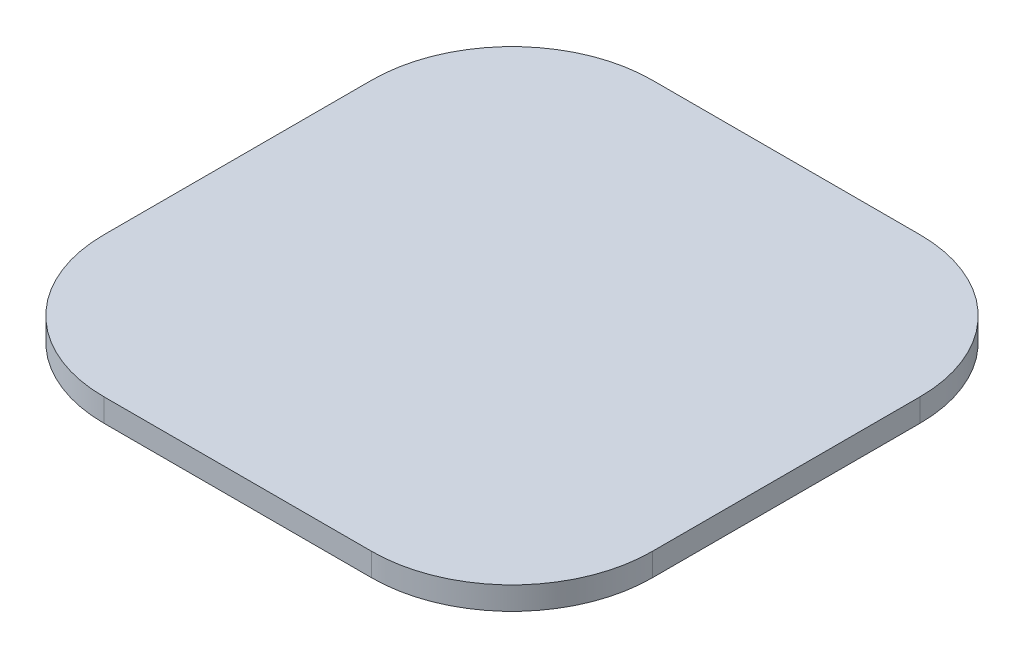
ISO-10303-21;
HEADER;
FILE_DESCRIPTION(('STEP AP214'),'2;1');
FILE_NAME('part.step','',(''),(''),'','','');
FILE_SCHEMA(('AUTOMOTIVE_DESIGN { 1 0 10303 214 1 1 1 1 }'));
ENDSEC;
DATA;
#1=APPLICATION_CONTEXT('core data for automotive mechanical design processes');
#2=APPLICATION_PROTOCOL_DEFINITION('international standard','automotive_design',2000,#1);
#3=PRODUCT_CONTEXT('',#1,'mechanical');
#4=PRODUCT('Part','Part','',(#3));
#5=PRODUCT_RELATED_PRODUCT_CATEGORY('part','',(#4));
#6=PRODUCT_DEFINITION_FORMATION('','',#4);
#7=PRODUCT_DEFINITION_CONTEXT('part definition',#1,'design');
#8=PRODUCT_DEFINITION('design','',#6,#7);
#9=PRODUCT_DEFINITION_SHAPE('','',#8);
#10=(LENGTH_UNIT() NAMED_UNIT(*) SI_UNIT(.MILLI.,.METRE.));
#11=(NAMED_UNIT(*) PLANE_ANGLE_UNIT() SI_UNIT($,.RADIAN.));
#12=(NAMED_UNIT(*) SI_UNIT($,.STERADIAN.) SOLID_ANGLE_UNIT());
#13=UNCERTAINTY_MEASURE_WITH_UNIT(LENGTH_MEASURE(1.E-05),#10,'distance_accuracy_value','');
#14=(GEOMETRIC_REPRESENTATION_CONTEXT(3) GLOBAL_UNCERTAINTY_ASSIGNED_CONTEXT((#13)) GLOBAL_UNIT_ASSIGNED_CONTEXT((#10,
#11,#12)) REPRESENTATION_CONTEXT('',''));
#15=CARTESIAN_POINT('',(0.,0.,0.));
#16=DIRECTION('',(0.,0.,1.));
#17=DIRECTION('',(1.,0.,0.));
#18=AXIS2_PLACEMENT_3D('',#15,#16,#17);
#19=CARTESIAN_POINT('',(-10.5,1.8,10.5));
#20=DIRECTION('',(0.,-1.,0.));
#21=DIRECTION('',(0.,0.,-1.));
#22=AXIS2_PLACEMENT_3D('',#19,#20,#21);
#23=CYLINDRICAL_SURFACE('',#22,11.);
#24=CARTESIAN_POINT('',(-10.5,0.,10.5));
#25=DIRECTION('',(0.,1.,0.));
#26=DIRECTION('',(0.,0.,-1.));
#27=AXIS2_PLACEMENT_3D('',#24,#25,#26);
#28=CIRCLE('',#27,11.);
#29=CARTESIAN_POINT('',(-21.5,0.,10.5));
#30=VERTEX_POINT('',#29);
#31=CARTESIAN_POINT('',(-10.5,0.,21.5));
#32=VERTEX_POINT('',#31);
#33=EDGE_CURVE('E129',#30,#32,#28,.T.);
#34=ORIENTED_EDGE('',*,*,#33,.T.);
#35=DIRECTION('',(0.,-1.,0.));
#36=VECTOR('',#35,1.);
#37=CARTESIAN_POINT('',(-10.5,1.8,21.5));
#38=LINE('',#37,#36);
#39=CARTESIAN_POINT('',(-10.5,1.8,21.5));
#40=VERTEX_POINT('',#39);
#41=EDGE_CURVE('E11',#40,#32,#38,.T.);
#42=ORIENTED_EDGE('',*,*,#41,.F.);
#43=CARTESIAN_POINT('',(-10.5,1.8,10.5));
#44=DIRECTION('',(0.,1.,0.));
#45=DIRECTION('',(0.,0.,-1.));
#46=AXIS2_PLACEMENT_3D('',#43,#44,#45);
#47=CIRCLE('',#46,11.);
#48=CARTESIAN_POINT('',(-21.5,1.8,10.5));
#49=VERTEX_POINT('',#48);
#50=EDGE_CURVE('E143',#49,#40,#47,.T.);
#51=ORIENTED_EDGE('',*,*,#50,.F.);
#52=DIRECTION('',(0.,-1.,0.));
#53=VECTOR('',#52,1.);
#54=CARTESIAN_POINT('',(-21.5,1.8,10.5));
#55=LINE('',#54,#53);
#56=EDGE_CURVE('E125',#49,#30,#55,.T.);
#57=ORIENTED_EDGE('',*,*,#56,.T.);
#58=EDGE_LOOP('',(#34,#42,#51,#57));
#59=FACE_BOUND('',#58,.T.);
#60=ADVANCED_FACE('F33',(#59),#23,.T.);
#61=CARTESIAN_POINT('',(10.5,1.8,21.5));
#62=DIRECTION('',(0.,0.,-1.));
#63=DIRECTION('',(-1.,0.,0.));
#64=AXIS2_PLACEMENT_3D('',#61,#62,#63);
#65=PLANE('',#64);
#66=DIRECTION('',(1.,0.,0.));
#67=VECTOR('',#66,1.);
#68=CARTESIAN_POINT('',(10.5,0.,21.5));
#69=LINE('',#68,#67);
#70=CARTESIAN_POINT('',(10.5,0.,21.5));
#71=VERTEX_POINT('',#70);
#72=EDGE_CURVE('E132',#32,#71,#69,.T.);
#73=ORIENTED_EDGE('',*,*,#72,.T.);
#74=DIRECTION('',(0.,-1.,0.));
#75=VECTOR('',#74,1.);
#76=CARTESIAN_POINT('',(10.5,1.8,21.5));
#77=LINE('',#76,#75);
#78=CARTESIAN_POINT('',(10.5,1.8,21.5));
#79=VERTEX_POINT('',#78);
#80=EDGE_CURVE('E41',#79,#71,#77,.T.);
#81=ORIENTED_EDGE('',*,*,#80,.F.);
#82=DIRECTION('',(1.,0.,0.));
#83=VECTOR('',#82,1.);
#84=CARTESIAN_POINT('',(10.5,1.8,21.5));
#85=LINE('',#84,#83);
#86=EDGE_CURVE('E92',#40,#79,#85,.T.);
#87=ORIENTED_EDGE('',*,*,#86,.F.);
#88=ORIENTED_EDGE('',*,*,#41,.T.);
#89=EDGE_LOOP('',(#73,#81,#87,#88));
#90=FACE_BOUND('',#89,.T.);
#91=ADVANCED_FACE('F178',(#90),#65,.F.);
#92=CARTESIAN_POINT('',(10.5,1.8,10.5));
#93=DIRECTION('',(0.,-1.,0.));
#94=DIRECTION('',(0.,0.,-1.));
#95=AXIS2_PLACEMENT_3D('',#92,#93,#94);
#96=CYLINDRICAL_SURFACE('',#95,11.);
#97=CARTESIAN_POINT('',(10.5,0.,10.5));
#98=DIRECTION('',(0.,1.,0.));
#99=DIRECTION('',(0.,0.,1.));
#100=AXIS2_PLACEMENT_3D('',#97,#98,#99);
#101=CIRCLE('',#100,11.);
#102=CARTESIAN_POINT('',(21.5,0.,10.5));
#103=VERTEX_POINT('',#102);
#104=EDGE_CURVE('E134',#71,#103,#101,.T.);
#105=ORIENTED_EDGE('',*,*,#104,.T.);
#106=DIRECTION('',(0.,-1.,0.));
#107=VECTOR('',#106,1.);
#108=CARTESIAN_POINT('',(21.5,1.8,10.5));
#109=LINE('',#108,#107);
#110=CARTESIAN_POINT('',(21.5,1.8,10.5));
#111=VERTEX_POINT('',#110);
#112=EDGE_CURVE('E150',#111,#103,#109,.T.);
#113=ORIENTED_EDGE('',*,*,#112,.F.);
#114=CARTESIAN_POINT('',(10.5,1.8,10.5));
#115=DIRECTION('',(0.,1.,0.));
#116=DIRECTION('',(0.,0.,1.));
#117=AXIS2_PLACEMENT_3D('',#114,#115,#116);
#118=CIRCLE('',#117,11.);
#119=EDGE_CURVE('E158',#79,#111,#118,.T.);
#120=ORIENTED_EDGE('',*,*,#119,.F.);
#121=ORIENTED_EDGE('',*,*,#80,.T.);
#122=EDGE_LOOP('',(#105,#113,#120,#121));
#123=FACE_BOUND('',#122,.T.);
#124=ADVANCED_FACE('F156',(#123),#96,.T.);
#125=CARTESIAN_POINT('',(21.5,1.8,10.5));
#126=DIRECTION('',(-1.,0.,0.));
#127=DIRECTION('',(0.,0.,1.));
#128=AXIS2_PLACEMENT_3D('',#125,#126,#127);
#129=PLANE('',#128);
#130=DIRECTION('',(0.,0.,-1.));
#131=VECTOR('',#130,1.);
#132=CARTESIAN_POINT('',(21.5,0.,10.5));
#133=LINE('',#132,#131);
#134=CARTESIAN_POINT('',(21.5,0.,-10.5));
#135=VERTEX_POINT('',#134);
#136=EDGE_CURVE('E136',#103,#135,#133,.T.);
#137=ORIENTED_EDGE('',*,*,#136,.T.);
#138=DIRECTION('',(0.,-1.,0.));
#139=VECTOR('',#138,1.);
#140=CARTESIAN_POINT('',(21.5,1.8,-10.5));
#141=LINE('',#140,#139);
#142=CARTESIAN_POINT('',(21.5,1.8,-10.5));
#143=VERTEX_POINT('',#142);
#144=EDGE_CURVE('E147',#143,#135,#141,.T.);
#145=ORIENTED_EDGE('',*,*,#144,.F.);
#146=DIRECTION('',(0.,0.,-1.));
#147=VECTOR('',#146,1.);
#148=CARTESIAN_POINT('',(21.5,1.8,10.5));
#149=LINE('',#148,#147);
#150=EDGE_CURVE('E170',#111,#143,#149,.T.);
#151=ORIENTED_EDGE('',*,*,#150,.F.);
#152=ORIENTED_EDGE('',*,*,#112,.T.);
#153=EDGE_LOOP('',(#137,#145,#151,#152));
#154=FACE_BOUND('',#153,.T.);
#155=ADVANCED_FACE('F166',(#154),#129,.F.);
#156=CARTESIAN_POINT('',(10.5,1.8,-10.5));
#157=DIRECTION('',(0.,-1.,0.));
#158=DIRECTION('',(0.,0.,-1.));
#159=AXIS2_PLACEMENT_3D('',#156,#157,#158);
#160=CYLINDRICAL_SURFACE('',#159,11.);
#161=CARTESIAN_POINT('',(10.5,0.,-10.5));
#162=DIRECTION('',(0.,1.,0.));
#163=DIRECTION('',(0.,0.,1.));
#164=AXIS2_PLACEMENT_3D('',#161,#162,#163);
#165=CIRCLE('',#164,11.);
#166=CARTESIAN_POINT('',(10.5,0.,-21.5));
#167=VERTEX_POINT('',#166);
#168=EDGE_CURVE('E138',#135,#167,#165,.T.);
#169=ORIENTED_EDGE('',*,*,#168,.T.);
#170=DIRECTION('',(0.,-1.,0.));
#171=VECTOR('',#170,1.);
#172=CARTESIAN_POINT('',(10.5,1.8,-21.5));
#173=LINE('',#172,#171);
#174=CARTESIAN_POINT('',(10.5,1.8,-21.5));
#175=VERTEX_POINT('',#174);
#176=EDGE_CURVE('E120',#175,#167,#173,.T.);
#177=ORIENTED_EDGE('',*,*,#176,.F.);
#178=CARTESIAN_POINT('',(10.5,1.8,-10.5));
#179=DIRECTION('',(0.,1.,0.));
#180=DIRECTION('',(0.,0.,1.));
#181=AXIS2_PLACEMENT_3D('',#178,#179,#180);
#182=CIRCLE('',#181,11.);
#183=EDGE_CURVE('E111',#143,#175,#182,.T.);
#184=ORIENTED_EDGE('',*,*,#183,.F.);
#185=ORIENTED_EDGE('',*,*,#144,.T.);
#186=EDGE_LOOP('',(#169,#177,#184,#185));
#187=FACE_BOUND('',#186,.T.);
#188=ADVANCED_FACE('F169',(#187),#160,.T.);
#189=CARTESIAN_POINT('',(10.5,1.8,-21.5));
#190=DIRECTION('',(0.,0.,1.));
#191=DIRECTION('',(1.,0.,0.));
#192=AXIS2_PLACEMENT_3D('',#189,#190,#191);
#193=PLANE('',#192);
#194=DIRECTION('',(-1.,0.,0.));
#195=VECTOR('',#194,1.);
#196=CARTESIAN_POINT('',(10.5,0.,-21.5));
#197=LINE('',#196,#195);
#198=CARTESIAN_POINT('',(-10.5,0.,-21.5));
#199=VERTEX_POINT('',#198);
#200=EDGE_CURVE('E119',#167,#199,#197,.T.);
#201=ORIENTED_EDGE('',*,*,#200,.T.);
#202=DIRECTION('',(0.,-1.,0.));
#203=VECTOR('',#202,1.);
#204=CARTESIAN_POINT('',(-10.5,1.8,-21.5));
#205=LINE('',#204,#203);
#206=CARTESIAN_POINT('',(-10.5,1.8,-21.5));
#207=VERTEX_POINT('',#206);
#208=EDGE_CURVE('E116',#207,#199,#205,.T.);
#209=ORIENTED_EDGE('',*,*,#208,.F.);
#210=DIRECTION('',(-1.,0.,0.));
#211=VECTOR('',#210,1.);
#212=CARTESIAN_POINT('',(10.5,1.8,-21.5));
#213=LINE('',#212,#211);
#214=EDGE_CURVE('E105',#175,#207,#213,.T.);
#215=ORIENTED_EDGE('',*,*,#214,.F.);
#216=ORIENTED_EDGE('',*,*,#176,.T.);
#217=EDGE_LOOP('',(#201,#209,#215,#216));
#218=FACE_BOUND('',#217,.T.);
#219=ADVANCED_FACE('F117',(#218),#193,.F.);
#220=CARTESIAN_POINT('',(-10.5,1.8,-10.5));
#221=DIRECTION('',(0.,-1.,0.));
#222=DIRECTION('',(0.,0.,-1.));
#223=AXIS2_PLACEMENT_3D('',#220,#221,#222);
#224=CYLINDRICAL_SURFACE('',#223,11.);
#225=CARTESIAN_POINT('',(-10.5,0.,-10.5));
#226=DIRECTION('',(0.,1.,0.));
#227=DIRECTION('',(0.,0.,1.));
#228=AXIS2_PLACEMENT_3D('',#225,#226,#227);
#229=CIRCLE('',#228,11.);
#230=CARTESIAN_POINT('',(-21.5,0.,-10.5));
#231=VERTEX_POINT('',#230);
#232=EDGE_CURVE('E78',#199,#231,#229,.T.);
#233=ORIENTED_EDGE('',*,*,#232,.T.);
#234=DIRECTION('',(0.,-1.,0.));
#235=VECTOR('',#234,1.);
#236=CARTESIAN_POINT('',(-21.5,1.8,-10.5));
#237=LINE('',#236,#235);
#238=CARTESIAN_POINT('',(-21.5,1.8,-10.5));
#239=VERTEX_POINT('',#238);
#240=EDGE_CURVE('E121',#239,#231,#237,.T.);
#241=ORIENTED_EDGE('',*,*,#240,.F.);
#242=CARTESIAN_POINT('',(-10.5,1.8,-10.5));
#243=DIRECTION('',(0.,1.,0.));
#244=DIRECTION('',(0.,0.,1.));
#245=AXIS2_PLACEMENT_3D('',#242,#243,#244);
#246=CIRCLE('',#245,11.);
#247=EDGE_CURVE('E109',#207,#239,#246,.T.);
#248=ORIENTED_EDGE('',*,*,#247,.F.);
#249=ORIENTED_EDGE('',*,*,#208,.T.);
#250=EDGE_LOOP('',(#233,#241,#248,#249));
#251=FACE_BOUND('',#250,.T.);
#252=ADVANCED_FACE('F123',(#251),#224,.T.);
#253=CARTESIAN_POINT('',(-21.5,1.8,10.5));
#254=DIRECTION('',(1.,0.,0.));
#255=DIRECTION('',(0.,0.,-1.));
#256=AXIS2_PLACEMENT_3D('',#253,#254,#255);
#257=PLANE('',#256);
#258=DIRECTION('',(0.,0.,1.));
#259=VECTOR('',#258,1.);
#260=CARTESIAN_POINT('',(-21.5,0.,10.5));
#261=LINE('',#260,#259);
#262=EDGE_CURVE('E84',#231,#30,#261,.T.);
#263=ORIENTED_EDGE('',*,*,#262,.T.);
#264=ORIENTED_EDGE('',*,*,#56,.F.);
#265=DIRECTION('',(0.,0.,1.));
#266=VECTOR('',#265,1.);
#267=CARTESIAN_POINT('',(-21.5,1.8,10.5));
#268=LINE('',#267,#266);
#269=EDGE_CURVE('E49',#239,#49,#268,.T.);
#270=ORIENTED_EDGE('',*,*,#269,.F.);
#271=ORIENTED_EDGE('',*,*,#240,.T.);
#272=EDGE_LOOP('',(#263,#264,#270,#271));
#273=FACE_BOUND('',#272,.T.);
#274=ADVANCED_FACE('F194',(#273),#257,.F.);
#275=CARTESIAN_POINT('',(-10.5,1.8,10.5));
#276=DIRECTION('',(0.,-1.,0.));
#277=DIRECTION('',(0.,0.,-1.));
#278=AXIS2_PLACEMENT_3D('',#275,#276,#277);
#279=PLANE('',#278);
#280=ORIENTED_EDGE('',*,*,#50,.T.);
#281=ORIENTED_EDGE('',*,*,#86,.T.);
#282=ORIENTED_EDGE('',*,*,#119,.T.);
#283=ORIENTED_EDGE('',*,*,#150,.T.);
#284=ORIENTED_EDGE('',*,*,#183,.T.);
#285=ORIENTED_EDGE('',*,*,#214,.T.);
#286=ORIENTED_EDGE('',*,*,#247,.T.);
#287=ORIENTED_EDGE('',*,*,#269,.T.);
#288=EDGE_LOOP('',(#280,#281,#282,#283,#284,#285,#286,#287));
#289=FACE_BOUND('',#288,.T.);
#290=ADVANCED_FACE('F107',(#289),#279,.F.);
#291=CARTESIAN_POINT('',(-10.5,0.,10.5));
#292=DIRECTION('',(0.,-1.,0.));
#293=DIRECTION('',(0.,0.,-1.));
#294=AXIS2_PLACEMENT_3D('',#291,#292,#293);
#295=PLANE('',#294);
#296=ORIENTED_EDGE('',*,*,#33,.F.);
#297=ORIENTED_EDGE('',*,*,#262,.F.);
#298=ORIENTED_EDGE('',*,*,#232,.F.);
#299=ORIENTED_EDGE('',*,*,#200,.F.);
#300=ORIENTED_EDGE('',*,*,#168,.F.);
#301=ORIENTED_EDGE('',*,*,#136,.F.);
#302=ORIENTED_EDGE('',*,*,#104,.F.);
#303=ORIENTED_EDGE('',*,*,#72,.F.);
#304=EDGE_LOOP('',(#296,#297,#298,#299,#300,#301,#302,#303));
#305=FACE_BOUND('',#304,.T.);
#306=ADVANCED_FACE('F162',(#305),#295,.T.);
#307=CLOSED_SHELL('',(#60,#91,#124,#155,#188,#219,#252,#274,#290,#306));
#308=MANIFOLD_SOLID_BREP('B2',#307);
#309=ADVANCED_BREP_SHAPE_REPRESENTATION('',(#18,#308),#14);
#310=SHAPE_DEFINITION_REPRESENTATION(#9,#309);
ENDSEC;
END-ISO-10303-21;
